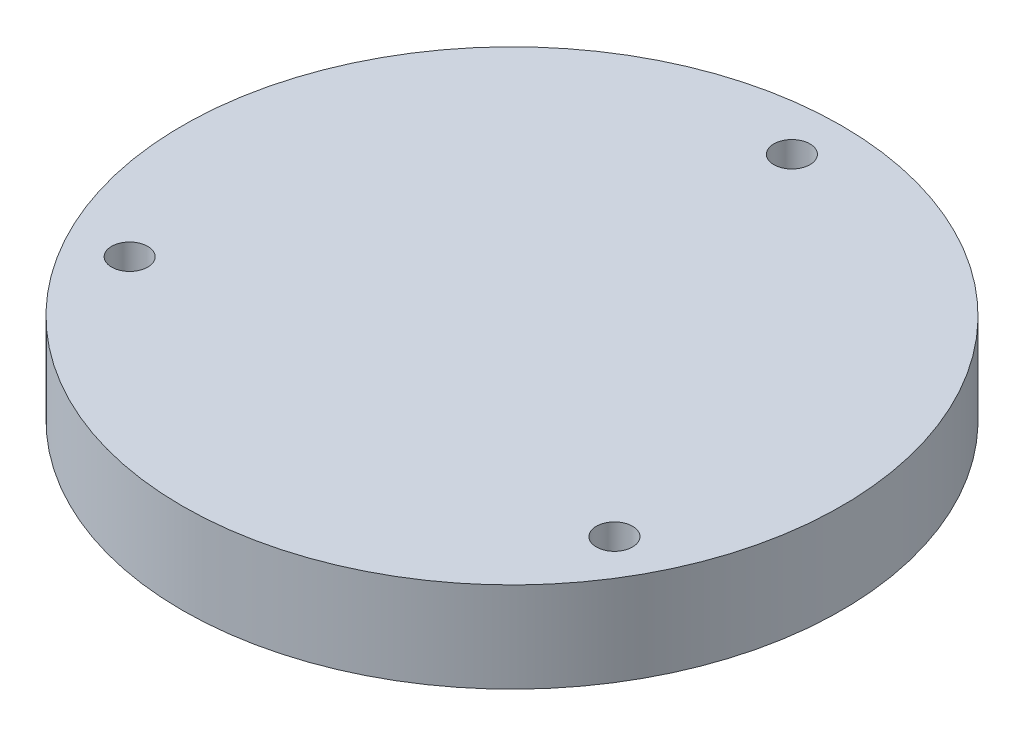
ISO-10303-21;
HEADER;
FILE_DESCRIPTION(('STEP AP214'),'2;1');
FILE_NAME('part.step','',(''),(''),'','','');
FILE_SCHEMA(('AUTOMOTIVE_DESIGN { 1 0 10303 214 1 1 1 1 }'));
ENDSEC;
DATA;
#1=APPLICATION_CONTEXT('core data for automotive mechanical design processes');
#2=APPLICATION_PROTOCOL_DEFINITION('international standard','automotive_design',2000,#1);
#3=PRODUCT_CONTEXT('',#1,'mechanical');
#4=PRODUCT('Part','Part','',(#3));
#5=PRODUCT_RELATED_PRODUCT_CATEGORY('part','',(#4));
#6=PRODUCT_DEFINITION_FORMATION('','',#4);
#7=PRODUCT_DEFINITION_CONTEXT('part definition',#1,'design');
#8=PRODUCT_DEFINITION('design','',#6,#7);
#9=PRODUCT_DEFINITION_SHAPE('','',#8);
#10=(LENGTH_UNIT() NAMED_UNIT(*) SI_UNIT(.MILLI.,.METRE.));
#11=(NAMED_UNIT(*) PLANE_ANGLE_UNIT() SI_UNIT($,.RADIAN.));
#12=(NAMED_UNIT(*) SI_UNIT($,.STERADIAN.) SOLID_ANGLE_UNIT());
#13=UNCERTAINTY_MEASURE_WITH_UNIT(LENGTH_MEASURE(1.E-05),#10,'distance_accuracy_value','');
#14=(GEOMETRIC_REPRESENTATION_CONTEXT(3) GLOBAL_UNCERTAINTY_ASSIGNED_CONTEXT((#13)) GLOBAL_UNIT_ASSIGNED_CONTEXT((#10,
#11,#12)) REPRESENTATION_CONTEXT('',''));
#15=CARTESIAN_POINT('',(0.,0.,0.));
#16=DIRECTION('',(0.,0.,1.));
#17=DIRECTION('',(1.,0.,0.));
#18=AXIS2_PLACEMENT_3D('',#15,#16,#17);
#19=CARTESIAN_POINT('',(0.,10.,0.));
#20=DIRECTION('',(0.,-1.,0.));
#21=DIRECTION('',(0.,0.,-1.));
#22=AXIS2_PLACEMENT_3D('',#19,#20,#21);
#23=CYLINDRICAL_SURFACE('',#22,36.5);
#24=CARTESIAN_POINT('',(0.,10.,0.));
#25=DIRECTION('',(0.,1.,0.));
#26=DIRECTION('',(0.,0.,1.));
#27=AXIS2_PLACEMENT_3D('',#24,#25,#26);
#28=CIRCLE('',#27,36.5);
#29=CARTESIAN_POINT('',(0.,10.,36.5));
#30=VERTEX_POINT('',#29);
#31=EDGE_CURVE('E10',#30,#30,#28,.T.);
#32=ORIENTED_EDGE('',*,*,#31,.F.);
#33=EDGE_LOOP('',(#32));
#34=FACE_BOUND('',#33,.T.);
#35=CARTESIAN_POINT('',(0.,0.,0.));
#36=DIRECTION('',(0.,1.,0.));
#37=DIRECTION('',(0.,0.,1.));
#38=AXIS2_PLACEMENT_3D('',#35,#36,#37);
#39=CIRCLE('',#38,36.5);
#40=CARTESIAN_POINT('',(0.,0.,36.5));
#41=VERTEX_POINT('',#40);
#42=EDGE_CURVE('E38',#41,#41,#39,.T.);
#43=ORIENTED_EDGE('',*,*,#42,.T.);
#44=EDGE_LOOP('',(#43));
#45=FACE_BOUND('',#44,.T.);
#46=ADVANCED_FACE('F35',(#34,#45),#23,.T.);
#47=CARTESIAN_POINT('',(0.,10.,0.));
#48=DIRECTION('',(0.,1.,0.));
#49=DIRECTION('',(0.,0.,1.));
#50=AXIS2_PLACEMENT_3D('',#47,#48,#49);
#51=PLANE('',#50);
#52=CARTESIAN_POINT('',(0.,10.,-31.));
#53=DIRECTION('',(0.,1.,0.));
#54=DIRECTION('',(0.,0.,1.));
#55=AXIS2_PLACEMENT_3D('',#52,#53,#54);
#56=CIRCLE('',#55,2.);
#57=CARTESIAN_POINT('',(0.,10.,-29.));
#58=VERTEX_POINT('',#57);
#59=EDGE_CURVE('E59',#58,#58,#56,.T.);
#60=ORIENTED_EDGE('',*,*,#59,.F.);
#61=EDGE_LOOP('',(#60));
#62=FACE_BOUND('',#61,.T.);
#63=CARTESIAN_POINT('',(26.8467875173196,10.,15.4999999999989));
#64=DIRECTION('',(0.,1.,0.));
#65=DIRECTION('',(0.,0.,1.));
#66=AXIS2_PLACEMENT_3D('',#63,#64,#65);
#67=CIRCLE('',#66,2.00000000000169);
#68=CARTESIAN_POINT('',(26.8467875173196,10.,17.5000000000006));
#69=VERTEX_POINT('',#68);
#70=EDGE_CURVE('E56',#69,#69,#67,.T.);
#71=ORIENTED_EDGE('',*,*,#70,.F.);
#72=EDGE_LOOP('',(#71));
#73=FACE_BOUND('',#72,.T.);
#74=CARTESIAN_POINT('',(-26.8467875173156,10.,15.5000000000012));
#75=DIRECTION('',(0.,1.,0.));
#76=DIRECTION('',(0.,0.,1.));
#77=AXIS2_PLACEMENT_3D('',#74,#75,#76);
#78=CIRCLE('',#77,2.0000000000025);
#79=CARTESIAN_POINT('',(-26.8467875173156,10.,17.5000000000037));
#80=VERTEX_POINT('',#79);
#81=EDGE_CURVE('E50',#80,#80,#78,.T.);
#82=ORIENTED_EDGE('',*,*,#81,.F.);
#83=EDGE_LOOP('',(#82));
#84=FACE_BOUND('',#83,.T.);
#85=ORIENTED_EDGE('',*,*,#31,.T.);
#86=EDGE_LOOP('',(#85));
#87=FACE_BOUND('',#86,.T.);
#88=ADVANCED_FACE('F75',(#62,#73,#84,#87),#51,.T.);
#89=CARTESIAN_POINT('',(0.,0.,0.));
#90=DIRECTION('',(0.,1.,0.));
#91=DIRECTION('',(0.,0.,1.));
#92=AXIS2_PLACEMENT_3D('',#89,#90,#91);
#93=PLANE('',#92);
#94=CARTESIAN_POINT('',(0.,0.,-31.));
#95=DIRECTION('',(0.,1.,0.));
#96=DIRECTION('',(0.,0.,1.));
#97=AXIS2_PLACEMENT_3D('',#94,#95,#96);
#98=CIRCLE('',#97,2.);
#99=CARTESIAN_POINT('',(0.,0.,-29.));
#100=VERTEX_POINT('',#99);
#101=EDGE_CURVE('E45',#100,#100,#98,.T.);
#102=ORIENTED_EDGE('',*,*,#101,.T.);
#103=EDGE_LOOP('',(#102));
#104=FACE_BOUND('',#103,.T.);
#105=CARTESIAN_POINT('',(26.8467875173196,0.,15.4999999999989));
#106=DIRECTION('',(0.,1.,0.));
#107=DIRECTION('',(0.,0.,1.));
#108=AXIS2_PLACEMENT_3D('',#105,#106,#107);
#109=CIRCLE('',#108,2.00000000000169);
#110=CARTESIAN_POINT('',(26.8467875173196,0.,17.5000000000006));
#111=VERTEX_POINT('',#110);
#112=EDGE_CURVE('E53',#111,#111,#109,.T.);
#113=ORIENTED_EDGE('',*,*,#112,.T.);
#114=EDGE_LOOP('',(#113));
#115=FACE_BOUND('',#114,.T.);
#116=CARTESIAN_POINT('',(-26.8467875173156,0.,15.5000000000012));
#117=DIRECTION('',(0.,1.,0.));
#118=DIRECTION('',(0.,0.,1.));
#119=AXIS2_PLACEMENT_3D('',#116,#117,#118);
#120=CIRCLE('',#119,2.0000000000025);
#121=CARTESIAN_POINT('',(-26.8467875173156,0.,17.5000000000037));
#122=VERTEX_POINT('',#121);
#123=EDGE_CURVE('E47',#122,#122,#120,.T.);
#124=ORIENTED_EDGE('',*,*,#123,.T.);
#125=EDGE_LOOP('',(#124));
#126=FACE_BOUND('',#125,.T.);
#127=ORIENTED_EDGE('',*,*,#42,.F.);
#128=EDGE_LOOP('',(#127));
#129=FACE_BOUND('',#128,.T.);
#130=ADVANCED_FACE('F65',(#104,#115,#126,#129),#93,.F.);
#131=CARTESIAN_POINT('',(-26.8467875173156,0.,15.5000000000012));
#132=DIRECTION('',(0.,1.,0.));
#133=DIRECTION('',(0.,0.,1.));
#134=AXIS2_PLACEMENT_3D('',#131,#132,#133);
#135=CYLINDRICAL_SURFACE('',#134,2.0000000000025);
#136=ORIENTED_EDGE('',*,*,#123,.F.);
#137=EDGE_LOOP('',(#136));
#138=FACE_BOUND('',#137,.T.);
#139=ORIENTED_EDGE('',*,*,#81,.T.);
#140=EDGE_LOOP('',(#139));
#141=FACE_BOUND('',#140,.T.);
#142=ADVANCED_FACE('F83',(#138,#141),#135,.F.);
#143=CARTESIAN_POINT('',(26.8467875173196,0.,15.4999999999989));
#144=DIRECTION('',(0.,1.,0.));
#145=DIRECTION('',(0.,0.,1.));
#146=AXIS2_PLACEMENT_3D('',#143,#144,#145);
#147=CYLINDRICAL_SURFACE('',#146,2.00000000000169);
#148=ORIENTED_EDGE('',*,*,#112,.F.);
#149=EDGE_LOOP('',(#148));
#150=FACE_BOUND('',#149,.T.);
#151=ORIENTED_EDGE('',*,*,#70,.T.);
#152=EDGE_LOOP('',(#151));
#153=FACE_BOUND('',#152,.T.);
#154=ADVANCED_FACE('F71',(#150,#153),#147,.F.);
#155=CARTESIAN_POINT('',(0.,0.,-31.));
#156=DIRECTION('',(0.,1.,0.));
#157=DIRECTION('',(0.,0.,1.));
#158=AXIS2_PLACEMENT_3D('',#155,#156,#157);
#159=CYLINDRICAL_SURFACE('',#158,2.);
#160=ORIENTED_EDGE('',*,*,#101,.F.);
#161=EDGE_LOOP('',(#160));
#162=FACE_BOUND('',#161,.T.);
#163=ORIENTED_EDGE('',*,*,#59,.T.);
#164=EDGE_LOOP('',(#163));
#165=FACE_BOUND('',#164,.T.);
#166=ADVANCED_FACE('F68',(#162,#165),#159,.F.);
#167=CLOSED_SHELL('',(#46,#88,#130,#142,#154,#166));
#168=MANIFOLD_SOLID_BREP('B2',#167);
#169=ADVANCED_BREP_SHAPE_REPRESENTATION('',(#18,#168),#14);
#170=SHAPE_DEFINITION_REPRESENTATION(#9,#169);
ENDSEC;
END-ISO-10303-21;
